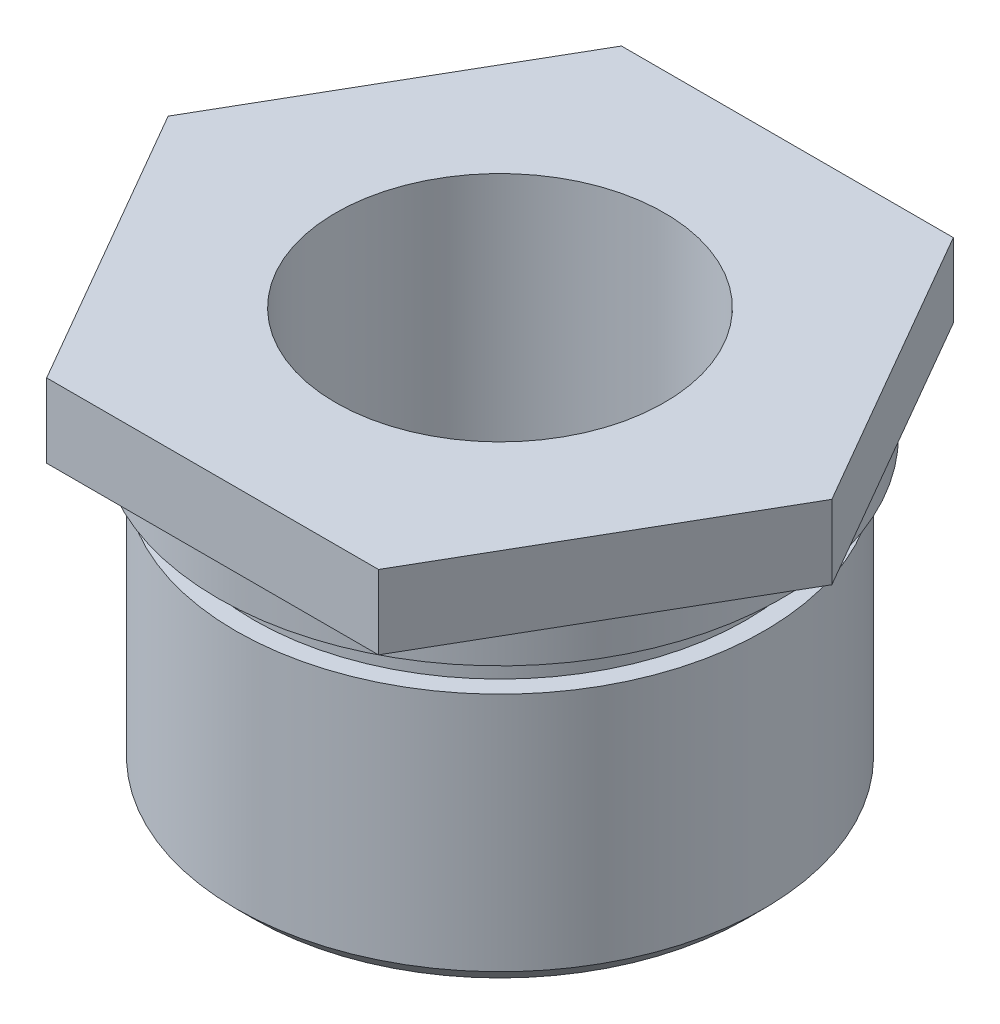
ISO-10303-21;
HEADER;
FILE_DESCRIPTION(('STEP AP214'),'2;1');
FILE_NAME('part.step','',(''),(''),'','','');
FILE_SCHEMA(('AUTOMOTIVE_DESIGN { 1 0 10303 214 1 1 1 1 }'));
ENDSEC;
DATA;
#1=APPLICATION_CONTEXT('core data for automotive mechanical design processes');
#2=APPLICATION_PROTOCOL_DEFINITION('international standard','automotive_design',2000,#1);
#3=PRODUCT_CONTEXT('',#1,'mechanical');
#4=PRODUCT('Part','Part','',(#3));
#5=PRODUCT_RELATED_PRODUCT_CATEGORY('part','',(#4));
#6=PRODUCT_DEFINITION_FORMATION('','',#4);
#7=PRODUCT_DEFINITION_CONTEXT('part definition',#1,'design');
#8=PRODUCT_DEFINITION('design','',#6,#7);
#9=PRODUCT_DEFINITION_SHAPE('','',#8);
#10=(LENGTH_UNIT() NAMED_UNIT(*) SI_UNIT(.MILLI.,.METRE.));
#11=(NAMED_UNIT(*) PLANE_ANGLE_UNIT() SI_UNIT($,.RADIAN.));
#12=(NAMED_UNIT(*) SI_UNIT($,.STERADIAN.) SOLID_ANGLE_UNIT());
#13=UNCERTAINTY_MEASURE_WITH_UNIT(LENGTH_MEASURE(1.E-05),#10,'distance_accuracy_value','');
#14=(GEOMETRIC_REPRESENTATION_CONTEXT(3) GLOBAL_UNCERTAINTY_ASSIGNED_CONTEXT((#13)) GLOBAL_UNIT_ASSIGNED_CONTEXT((#10,
#11,#12)) REPRESENTATION_CONTEXT('',''));
#15=CARTESIAN_POINT('',(0.,0.,0.));
#16=DIRECTION('',(0.,0.,1.));
#17=DIRECTION('',(1.,0.,0.));
#18=AXIS2_PLACEMENT_3D('',#15,#16,#17);
#19=CARTESIAN_POINT('',(0.,13.8545880540538,0.));
#20=DIRECTION('',(0.,1.,0.));
#21=DIRECTION('',(0.,0.,1.));
#22=AXIS2_PLACEMENT_3D('',#19,#20,#21);
#23=CYLINDRICAL_SURFACE('',#22,7.62);
#24=CARTESIAN_POINT('',(0.,2.5,0.));
#25=DIRECTION('',(0.,1.,0.));
#26=DIRECTION('',(0.,0.,1.));
#27=AXIS2_PLACEMENT_3D('',#24,#25,#26);
#28=CIRCLE('',#27,7.62);
#29=CARTESIAN_POINT('',(0.,2.5,7.61999999999997));
#30=VERTEX_POINT('',#29);
#31=EDGE_CURVE('E144',#30,#30,#28,.T.);
#32=ORIENTED_EDGE('',*,*,#31,.T.);
#33=EDGE_LOOP('',(#32));
#34=FACE_BOUND('',#33,.T.);
#35=CARTESIAN_POINT('',(0.,3.5,0.));
#36=DIRECTION('',(0.,1.,0.));
#37=DIRECTION('',(0.,0.,1.));
#38=AXIS2_PLACEMENT_3D('',#35,#36,#37);
#39=CIRCLE('',#38,7.62);
#40=CARTESIAN_POINT('',(0.,3.5,7.61999999999997));
#41=VERTEX_POINT('',#40);
#42=EDGE_CURVE('E150',#41,#41,#39,.T.);
#43=ORIENTED_EDGE('',*,*,#42,.F.);
#44=EDGE_LOOP('',(#43));
#45=FACE_BOUND('',#44,.T.);
#46=ADVANCED_FACE('F38',(#34,#45),#23,.T.);
#47=CARTESIAN_POINT('',(0.,5.50000000000001,0.));
#48=DIRECTION('',(0.,-1.,0.));
#49=DIRECTION('',(0.,0.,-1.));
#50=AXIS2_PLACEMENT_3D('',#47,#48,#49);
#51=PLANE('',#50);
#52=CARTESIAN_POINT('',(0.,5.50000000000001,0.));
#53=DIRECTION('',(0.,1.,0.));
#54=DIRECTION('',(0.,0.,1.));
#55=AXIS2_PLACEMENT_3D('',#52,#53,#54);
#56=CIRCLE('',#55,4.445);
#57=CARTESIAN_POINT('',(0.,5.5,4.44500000000001));
#58=VERTEX_POINT('',#57);
#59=EDGE_CURVE('E153',#58,#58,#56,.T.);
#60=ORIENTED_EDGE('',*,*,#59,.F.);
#61=EDGE_LOOP('',(#60));
#62=FACE_BOUND('',#61,.T.);
#63=DIRECTION('',(-1.,0.,0.));
#64=VECTOR('',#63,1.);
#65=CARTESIAN_POINT('',(0.,5.50000000000001,-7.7724));
#66=LINE('',#65,#64);
#67=CARTESIAN_POINT('',(4.48739723224943,5.50000000000001,-7.77240000000002));
#68=VERTEX_POINT('',#67);
#69=CARTESIAN_POINT('',(-4.48739723224946,5.49999999999998,-7.77239999999999));
#70=VERTEX_POINT('',#69);
#71=EDGE_CURVE('E127',#68,#70,#66,.T.);
#72=ORIENTED_EDGE('',*,*,#71,.T.);
#73=DIRECTION('',(-0.5,0.,0.866025403784439));
#74=VECTOR('',#73,1.);
#75=CARTESIAN_POINT('',(-6.7310958483742,5.50000000000001,-3.88620000000001));
#76=LINE('',#75,#74);
#77=CARTESIAN_POINT('',(-8.97479446449895,5.49999999999995,0.));
#78=VERTEX_POINT('',#77);
#79=EDGE_CURVE('E130',#70,#78,#76,.T.);
#80=ORIENTED_EDGE('',*,*,#79,.T.);
#81=DIRECTION('',(0.5,0.,0.866025403784439));
#82=VECTOR('',#81,1.);
#83=CARTESIAN_POINT('',(-6.73109584837421,5.49999999999998,3.88619999999999));
#84=LINE('',#83,#82);
#85=CARTESIAN_POINT('',(-4.48739723224953,5.49999999999998,7.77239999999999));
#86=VERTEX_POINT('',#85);
#87=EDGE_CURVE('E133',#78,#86,#84,.T.);
#88=ORIENTED_EDGE('',*,*,#87,.T.);
#89=DIRECTION('',(1.,0.,0.));
#90=VECTOR('',#89,1.);
#91=CARTESIAN_POINT('',(0.,5.50000000000001,7.77239999999999));
#92=LINE('',#91,#90);
#93=CARTESIAN_POINT('',(4.48739723224936,5.50000000000001,7.77239999999999));
#94=VERTEX_POINT('',#93);
#95=EDGE_CURVE('E136',#86,#94,#92,.T.);
#96=ORIENTED_EDGE('',*,*,#95,.T.);
#97=DIRECTION('',(0.5,0.,-0.866025403784439));
#98=VECTOR('',#97,1.);
#99=CARTESIAN_POINT('',(6.73109584837413,5.49999999999995,3.8862));
#100=LINE('',#99,#98);
#101=CARTESIAN_POINT('',(8.97479446449885,5.49999999999998,0.));
#102=VERTEX_POINT('',#101);
#103=EDGE_CURVE('E103',#94,#102,#100,.T.);
#104=ORIENTED_EDGE('',*,*,#103,.T.);
#105=DIRECTION('',(-0.5,0.,-0.866025403784439));
#106=VECTOR('',#105,1.);
#107=CARTESIAN_POINT('',(6.73109584837415,5.49999999999998,-3.8862));
#108=LINE('',#107,#106);
#109=EDGE_CURVE('E139',#102,#68,#108,.T.);
#110=ORIENTED_EDGE('',*,*,#109,.T.);
#111=EDGE_LOOP('',(#72,#80,#88,#96,#104,#110));
#112=FACE_BOUND('',#111,.T.);
#113=ADVANCED_FACE('F185',(#62,#112),#51,.F.);
#114=CARTESIAN_POINT('',(0.,13.8545880540538,0.));
#115=DIRECTION('',(0.,1.,0.));
#116=DIRECTION('',(0.,0.,1.));
#117=AXIS2_PLACEMENT_3D('',#114,#115,#116);
#118=CYLINDRICAL_SURFACE('',#117,4.445);
#119=ORIENTED_EDGE('',*,*,#59,.T.);
#120=EDGE_LOOP('',(#119));
#121=FACE_BOUND('',#120,.T.);
#122=CARTESIAN_POINT('',(0.,-5.50000000000001,0.));
#123=DIRECTION('',(0.,1.,0.));
#124=DIRECTION('',(0.,0.,1.));
#125=AXIS2_PLACEMENT_3D('',#122,#123,#124);
#126=CIRCLE('',#125,4.445);
#127=CARTESIAN_POINT('',(0.,-5.50000000000001,4.44499999999997));
#128=VERTEX_POINT('',#127);
#129=EDGE_CURVE('E165',#128,#128,#126,.T.);
#130=ORIENTED_EDGE('',*,*,#129,.F.);
#131=EDGE_LOOP('',(#130));
#132=FACE_BOUND('',#131,.T.);
#133=ADVANCED_FACE('F190',(#121,#132),#118,.F.);
#134=CARTESIAN_POINT('',(0.,-5.50000000000001,0.));
#135=DIRECTION('',(0.,1.,0.));
#136=DIRECTION('',(0.,0.,1.));
#137=AXIS2_PLACEMENT_3D('',#134,#135,#136);
#138=PLANE('',#137);
#139=CARTESIAN_POINT('',(0.,-5.50000000000001,0.));
#140=DIRECTION('',(0.,1.,0.));
#141=DIRECTION('',(0.,0.,1.));
#142=AXIS2_PLACEMENT_3D('',#139,#140,#141);
#143=CIRCLE('',#142,6.64374999999998);
#144=CARTESIAN_POINT('',(0.,-5.50000000000001,6.64374999999995));
#145=VERTEX_POINT('',#144);
#146=EDGE_CURVE('E11',#145,#145,#143,.F.);
#147=ORIENTED_EDGE('',*,*,#146,.T.);
#148=EDGE_LOOP('',(#147));
#149=FACE_BOUND('',#148,.T.);
#150=ORIENTED_EDGE('',*,*,#129,.T.);
#151=EDGE_LOOP('',(#150));
#152=FACE_BOUND('',#151,.T.);
#153=ADVANCED_FACE('F197',(#149,#152),#138,.F.);
#154=CARTESIAN_POINT('',(0.,13.8545880540538,0.));
#155=DIRECTION('',(0.,1.,0.));
#156=DIRECTION('',(0.,0.,1.));
#157=AXIS2_PLACEMENT_3D('',#154,#155,#156);
#158=CYLINDRICAL_SURFACE('',#157,7.14375);
#159=CARTESIAN_POINT('',(0.,-4.99999999999998,0.));
#160=DIRECTION('',(0.,1.,0.));
#161=DIRECTION('',(0.,0.,1.));
#162=AXIS2_PLACEMENT_3D('',#159,#160,#161);
#163=CIRCLE('',#162,7.14375);
#164=CARTESIAN_POINT('',(0.,-4.99999999999998,7.14374999999997));
#165=VERTEX_POINT('',#164);
#166=EDGE_CURVE('E47',#165,#165,#163,.T.);
#167=ORIENTED_EDGE('',*,*,#166,.T.);
#168=EDGE_LOOP('',(#167));
#169=FACE_BOUND('',#168,.T.);
#170=CARTESIAN_POINT('',(0.,1.5,0.));
#171=DIRECTION('',(0.,1.,0.));
#172=DIRECTION('',(0.,0.,1.));
#173=AXIS2_PLACEMENT_3D('',#170,#171,#172);
#174=CIRCLE('',#173,7.14375);
#175=CARTESIAN_POINT('',(0.,1.5,7.14374999999999));
#176=VERTEX_POINT('',#175);
#177=EDGE_CURVE('E162',#176,#176,#174,.T.);
#178=ORIENTED_EDGE('',*,*,#177,.F.);
#179=EDGE_LOOP('',(#178));
#180=FACE_BOUND('',#179,.T.);
#181=ADVANCED_FACE('F172',(#169,#180),#158,.T.);
#182=CARTESIAN_POINT('',(0.,1.5,0.));
#183=DIRECTION('',(0.,-1.,0.));
#184=DIRECTION('',(0.,0.,-1.));
#185=AXIS2_PLACEMENT_3D('',#182,#183,#184);
#186=PLANE('',#185);
#187=CARTESIAN_POINT('',(0.,1.5,0.));
#188=DIRECTION('',(0.,1.,0.));
#189=DIRECTION('',(0.,0.,1.));
#190=AXIS2_PLACEMENT_3D('',#187,#188,#189);
#191=CIRCLE('',#190,6.64375);
#192=CARTESIAN_POINT('',(0.,1.5,6.64374999999999));
#193=VERTEX_POINT('',#192);
#194=EDGE_CURVE('E159',#193,#193,#191,.T.);
#195=ORIENTED_EDGE('',*,*,#194,.F.);
#196=EDGE_LOOP('',(#195));
#197=FACE_BOUND('',#196,.T.);
#198=ORIENTED_EDGE('',*,*,#177,.T.);
#199=EDGE_LOOP('',(#198));
#200=FACE_BOUND('',#199,.T.);
#201=ADVANCED_FACE('F204',(#197,#200),#186,.F.);
#202=CARTESIAN_POINT('',(0.,13.8545880540538,0.));
#203=DIRECTION('',(0.,1.,0.));
#204=DIRECTION('',(0.,0.,1.));
#205=AXIS2_PLACEMENT_3D('',#202,#203,#204);
#206=CYLINDRICAL_SURFACE('',#205,6.64375);
#207=CARTESIAN_POINT('',(0.,2.5,0.));
#208=DIRECTION('',(0.,1.,0.));
#209=DIRECTION('',(0.,0.,1.));
#210=AXIS2_PLACEMENT_3D('',#207,#208,#209);
#211=CIRCLE('',#210,6.64375);
#212=CARTESIAN_POINT('',(0.,2.5,6.64374999999997));
#213=VERTEX_POINT('',#212);
#214=EDGE_CURVE('E156',#213,#213,#211,.T.);
#215=ORIENTED_EDGE('',*,*,#214,.F.);
#216=EDGE_LOOP('',(#215));
#217=FACE_BOUND('',#216,.T.);
#218=ORIENTED_EDGE('',*,*,#194,.T.);
#219=EDGE_LOOP('',(#218));
#220=FACE_BOUND('',#219,.T.);
#221=ADVANCED_FACE('F207',(#217,#220),#206,.T.);
#222=CARTESIAN_POINT('',(0.,2.5,0.));
#223=DIRECTION('',(0.,1.,0.));
#224=DIRECTION('',(0.,0.,1.));
#225=AXIS2_PLACEMENT_3D('',#222,#223,#224);
#226=PLANE('',#225);
#227=ORIENTED_EDGE('',*,*,#31,.F.);
#228=EDGE_LOOP('',(#227));
#229=FACE_BOUND('',#228,.T.);
#230=ORIENTED_EDGE('',*,*,#214,.T.);
#231=EDGE_LOOP('',(#230));
#232=FACE_BOUND('',#231,.T.);
#233=ADVANCED_FACE('F211',(#229,#232),#226,.F.);
#234=CARTESIAN_POINT('',(0.,3.5,0.));
#235=DIRECTION('',(0.,1.,0.));
#236=DIRECTION('',(0.,0.,1.));
#237=AXIS2_PLACEMENT_3D('',#234,#235,#236);
#238=PLANE('',#237);
#239=DIRECTION('',(-1.,0.,0.));
#240=VECTOR('',#239,1.);
#241=CARTESIAN_POINT('',(0.,3.5,-7.77240000000003));
#242=LINE('',#241,#240);
#243=CARTESIAN_POINT('',(4.48739723224946,3.5,-7.77240000000003));
#244=VERTEX_POINT('',#243);
#245=CARTESIAN_POINT('',(-4.48739723224945,3.49999999999998,-7.77240000000001));
#246=VERTEX_POINT('',#245);
#247=EDGE_CURVE('E142',#244,#246,#242,.T.);
#248=ORIENTED_EDGE('',*,*,#247,.F.);
#249=DIRECTION('',(-0.5,0.,-0.866025403784439));
#250=VECTOR('',#249,1.);
#251=CARTESIAN_POINT('',(6.73109584837417,3.49999999999998,-3.8862));
#252=LINE('',#251,#250);
#253=CARTESIAN_POINT('',(8.97479446449891,3.5,0.));
#254=VERTEX_POINT('',#253);
#255=EDGE_CURVE('E117',#254,#244,#252,.T.);
#256=ORIENTED_EDGE('',*,*,#255,.F.);
#257=DIRECTION('',(0.5,0.,-0.866025403784439));
#258=VECTOR('',#257,1.);
#259=CARTESIAN_POINT('',(6.73109584837414,3.49999999999995,3.8862));
#260=LINE('',#259,#258);
#261=CARTESIAN_POINT('',(4.48739723224945,3.5,7.77239999999998));
#262=VERTEX_POINT('',#261);
#263=EDGE_CURVE('E101',#262,#254,#260,.T.);
#264=ORIENTED_EDGE('',*,*,#263,.F.);
#265=DIRECTION('',(1.,0.,0.));
#266=VECTOR('',#265,1.);
#267=CARTESIAN_POINT('',(0.,3.5,7.77239999999999));
#268=LINE('',#267,#266);
#269=CARTESIAN_POINT('',(-4.48739723224946,3.49999999999998,7.7724));
#270=VERTEX_POINT('',#269);
#271=EDGE_CURVE('E115',#270,#262,#268,.T.);
#272=ORIENTED_EDGE('',*,*,#271,.F.);
#273=DIRECTION('',(0.5,0.,0.866025403784439));
#274=VECTOR('',#273,1.);
#275=CARTESIAN_POINT('',(-6.7310958483742,3.49999999999998,3.88619999999998));
#276=LINE('',#275,#274);
#277=CARTESIAN_POINT('',(-8.97479446449891,3.49999999999995,0.));
#278=VERTEX_POINT('',#277);
#279=EDGE_CURVE('E120',#278,#270,#276,.T.);
#280=ORIENTED_EDGE('',*,*,#279,.F.);
#281=DIRECTION('',(-0.5,0.,0.866025403784439));
#282=VECTOR('',#281,1.);
#283=CARTESIAN_POINT('',(-6.73109584837417,3.5,-3.88620000000001));
#284=LINE('',#283,#282);
#285=EDGE_CURVE('E122',#246,#278,#284,.T.);
#286=ORIENTED_EDGE('',*,*,#285,.F.);
#287=EDGE_LOOP('',(#248,#256,#264,#272,#280,#286));
#288=FACE_BOUND('',#287,.T.);
#289=ORIENTED_EDGE('',*,*,#42,.T.);
#290=EDGE_LOOP('',(#289));
#291=FACE_BOUND('',#290,.T.);
#292=ADVANCED_FACE('F112',(#288,#291),#238,.F.);
#293=CARTESIAN_POINT('',(0.,3.5,-7.77240000000003));
#294=DIRECTION('',(0.,0.,-1.));
#295=DIRECTION('',(0.,1.,0.));
#296=AXIS2_PLACEMENT_3D('',#293,#294,#295);
#297=PLANE('',#296);
#298=ORIENTED_EDGE('',*,*,#71,.F.);
#299=DIRECTION('',(0.,1.,0.));
#300=VECTOR('',#299,1.);
#301=CARTESIAN_POINT('',(4.48739723224946,3.5,-7.77240000000003));
#302=LINE('',#301,#300);
#303=EDGE_CURVE('E55',#244,#68,#302,.T.);
#304=ORIENTED_EDGE('',*,*,#303,.F.);
#305=ORIENTED_EDGE('',*,*,#247,.T.);
#306=DIRECTION('',(0.,1.,0.));
#307=VECTOR('',#306,1.);
#308=CARTESIAN_POINT('',(-4.48739723224945,3.49999999999998,-7.77240000000001));
#309=LINE('',#308,#307);
#310=EDGE_CURVE('E90',#246,#70,#309,.T.);
#311=ORIENTED_EDGE('',*,*,#310,.T.);
#312=EDGE_LOOP('',(#298,#304,#305,#311));
#313=FACE_BOUND('',#312,.T.);
#314=ADVANCED_FACE('F216',(#313),#297,.T.);
#315=CARTESIAN_POINT('',(6.73109584837417,3.49999999999998,-3.8862));
#316=DIRECTION('',(0.866025403784439,0.,-0.5));
#317=DIRECTION('',(-0.5,0.,-0.866025403784439));
#318=AXIS2_PLACEMENT_3D('',#315,#316,#317);
#319=PLANE('',#318);
#320=ORIENTED_EDGE('',*,*,#109,.F.);
#321=DIRECTION('',(0.,1.,0.));
#322=VECTOR('',#321,1.);
#323=CARTESIAN_POINT('',(8.97479446449891,3.5,0.));
#324=LINE('',#323,#322);
#325=EDGE_CURVE('E78',#254,#102,#324,.T.);
#326=ORIENTED_EDGE('',*,*,#325,.F.);
#327=ORIENTED_EDGE('',*,*,#255,.T.);
#328=ORIENTED_EDGE('',*,*,#303,.T.);
#329=EDGE_LOOP('',(#320,#326,#327,#328));
#330=FACE_BOUND('',#329,.T.);
#331=ADVANCED_FACE('F218',(#330),#319,.T.);
#332=CARTESIAN_POINT('',(6.73109584837414,3.49999999999995,3.8862));
#333=DIRECTION('',(0.866025403784439,0.,0.5));
#334=DIRECTION('',(0.5,0.,-0.866025403784439));
#335=AXIS2_PLACEMENT_3D('',#332,#333,#334);
#336=PLANE('',#335);
#337=ORIENTED_EDGE('',*,*,#103,.F.);
#338=DIRECTION('',(0.,1.,0.));
#339=VECTOR('',#338,1.);
#340=CARTESIAN_POINT('',(4.48739723224945,3.5,7.77239999999998));
#341=LINE('',#340,#339);
#342=EDGE_CURVE('E98',#262,#94,#341,.T.);
#343=ORIENTED_EDGE('',*,*,#342,.F.);
#344=ORIENTED_EDGE('',*,*,#263,.T.);
#345=ORIENTED_EDGE('',*,*,#325,.T.);
#346=EDGE_LOOP('',(#337,#343,#344,#345));
#347=FACE_BOUND('',#346,.T.);
#348=ADVANCED_FACE('F100',(#347),#336,.T.);
#349=CARTESIAN_POINT('',(0.,3.5,7.77239999999999));
#350=DIRECTION('',(0.,0.,1.));
#351=DIRECTION('',(0.,-1.,0.));
#352=AXIS2_PLACEMENT_3D('',#349,#350,#351);
#353=PLANE('',#352);
#354=ORIENTED_EDGE('',*,*,#95,.F.);
#355=DIRECTION('',(0.,1.,0.));
#356=VECTOR('',#355,1.);
#357=CARTESIAN_POINT('',(-4.48739723224946,3.49999999999998,7.7724));
#358=LINE('',#357,#356);
#359=EDGE_CURVE('E108',#270,#86,#358,.T.);
#360=ORIENTED_EDGE('',*,*,#359,.F.);
#361=ORIENTED_EDGE('',*,*,#271,.T.);
#362=ORIENTED_EDGE('',*,*,#342,.T.);
#363=EDGE_LOOP('',(#354,#360,#361,#362));
#364=FACE_BOUND('',#363,.T.);
#365=ADVANCED_FACE('F119',(#364),#353,.T.);
#366=CARTESIAN_POINT('',(-6.7310958483742,3.49999999999998,3.88619999999998));
#367=DIRECTION('',(-0.866025403784439,0.,0.5));
#368=DIRECTION('',(0.5,0.,0.866025403784439));
#369=AXIS2_PLACEMENT_3D('',#366,#367,#368);
#370=PLANE('',#369);
#371=ORIENTED_EDGE('',*,*,#87,.F.);
#372=DIRECTION('',(0.,1.,0.));
#373=VECTOR('',#372,1.);
#374=CARTESIAN_POINT('',(-8.97479446449891,3.49999999999995,0.));
#375=LINE('',#374,#373);
#376=EDGE_CURVE('E147',#278,#78,#375,.T.);
#377=ORIENTED_EDGE('',*,*,#376,.F.);
#378=ORIENTED_EDGE('',*,*,#279,.T.);
#379=ORIENTED_EDGE('',*,*,#359,.T.);
#380=EDGE_LOOP('',(#371,#377,#378,#379));
#381=FACE_BOUND('',#380,.T.);
#382=ADVANCED_FACE('F181',(#381),#370,.T.);
#383=CARTESIAN_POINT('',(-6.73109584837417,3.5,-3.88620000000001));
#384=DIRECTION('',(-0.866025403784439,0.,-0.5));
#385=DIRECTION('',(-0.5,0.,0.866025403784439));
#386=AXIS2_PLACEMENT_3D('',#383,#384,#385);
#387=PLANE('',#386);
#388=ORIENTED_EDGE('',*,*,#79,.F.);
#389=ORIENTED_EDGE('',*,*,#310,.F.);
#390=ORIENTED_EDGE('',*,*,#285,.T.);
#391=ORIENTED_EDGE('',*,*,#376,.T.);
#392=EDGE_LOOP('',(#388,#389,#390,#391));
#393=FACE_BOUND('',#392,.T.);
#394=ADVANCED_FACE('F176',(#393),#387,.T.);
#395=CARTESIAN_POINT('',(0.,-4.99999999999998,0.));
#396=DIRECTION('',(0.,1.,0.));
#397=DIRECTION('',(0.,0.,1.));
#398=AXIS2_PLACEMENT_3D('',#395,#396,#397);
#399=CONICAL_SURFACE('',#398,7.14375,0.78539816339745);
#400=ORIENTED_EDGE('',*,*,#146,.F.);
#401=EDGE_LOOP('',(#400));
#402=FACE_BOUND('',#401,.T.);
#403=ORIENTED_EDGE('',*,*,#166,.F.);
#404=EDGE_LOOP('',(#403));
#405=FACE_BOUND('',#404,.T.);
#406=ADVANCED_FACE('F40',(#402,#405),#399,.T.);
#407=CLOSED_SHELL('',(#46,#113,#133,#153,#181,#201,#221,#233,#292,#314,#331,#348,#365,#382,#394,#406));
#408=MANIFOLD_SOLID_BREP('B2',#407);
#409=ADVANCED_BREP_SHAPE_REPRESENTATION('',(#18,#408),#14);
#410=SHAPE_DEFINITION_REPRESENTATION(#9,#409);
ENDSEC;
END-ISO-10303-21;
